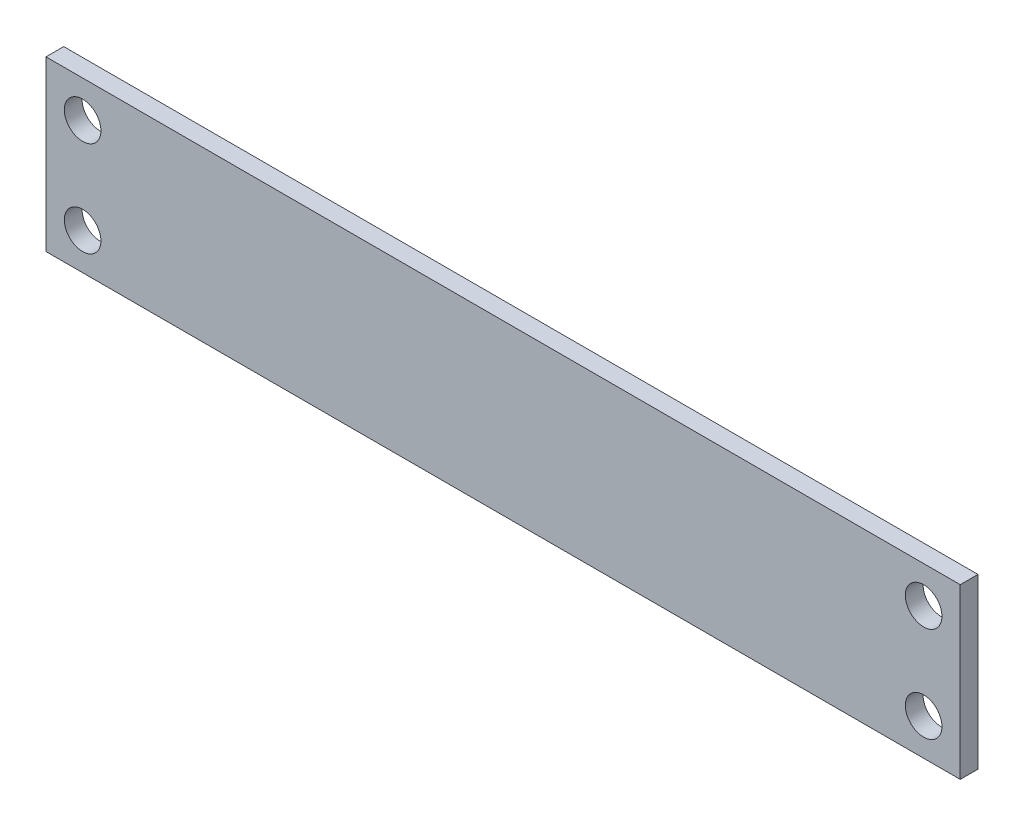
ISO-10303-21;
HEADER;
FILE_DESCRIPTION(('STEP AP214'),'2;1');
FILE_NAME('part.step','',(''),(''),'','','');
FILE_SCHEMA(('AUTOMOTIVE_DESIGN { 1 0 10303 214 1 1 1 1 }'));
ENDSEC;
DATA;
#1=APPLICATION_CONTEXT('core data for automotive mechanical design processes');
#2=APPLICATION_PROTOCOL_DEFINITION('international standard','automotive_design',2000,#1);
#3=PRODUCT_CONTEXT('',#1,'mechanical');
#4=PRODUCT('Part','Part','',(#3));
#5=PRODUCT_RELATED_PRODUCT_CATEGORY('part','',(#4));
#6=PRODUCT_DEFINITION_FORMATION('','',#4);
#7=PRODUCT_DEFINITION_CONTEXT('part definition',#1,'design');
#8=PRODUCT_DEFINITION('design','',#6,#7);
#9=PRODUCT_DEFINITION_SHAPE('','',#8);
#10=(LENGTH_UNIT() NAMED_UNIT(*) SI_UNIT(.MILLI.,.METRE.));
#11=(NAMED_UNIT(*) PLANE_ANGLE_UNIT() SI_UNIT($,.RADIAN.));
#12=(NAMED_UNIT(*) SI_UNIT($,.STERADIAN.) SOLID_ANGLE_UNIT());
#13=UNCERTAINTY_MEASURE_WITH_UNIT(LENGTH_MEASURE(1.E-05),#10,'distance_accuracy_value','');
#14=(GEOMETRIC_REPRESENTATION_CONTEXT(3) GLOBAL_UNCERTAINTY_ASSIGNED_CONTEXT((#13)) GLOBAL_UNIT_ASSIGNED_CONTEXT((#10,
#11,#12)) REPRESENTATION_CONTEXT('',''));
#15=CARTESIAN_POINT('',(0.,0.,0.));
#16=DIRECTION('',(0.,0.,1.));
#17=DIRECTION('',(1.,0.,0.));
#18=AXIS2_PLACEMENT_3D('',#15,#16,#17);
#19=CARTESIAN_POINT('',(-41.2,7.6,1.6));
#20=DIRECTION('',(1.,0.,0.));
#21=DIRECTION('',(0.,1.,0.));
#22=AXIS2_PLACEMENT_3D('',#19,#20,#21);
#23=PLANE('',#22);
#24=DIRECTION('',(0.,-1.,0.));
#25=VECTOR('',#24,1.);
#26=CARTESIAN_POINT('',(-41.2,7.6,0.));
#27=LINE('',#26,#25);
#28=CARTESIAN_POINT('',(-41.2,7.6,0.));
#29=VERTEX_POINT('',#28);
#30=CARTESIAN_POINT('',(-41.2,-7.6,0.));
#31=VERTEX_POINT('',#30);
#32=EDGE_CURVE('E102',#29,#31,#27,.T.);
#33=ORIENTED_EDGE('',*,*,#32,.T.);
#34=DIRECTION('',(0.,0.,-1.));
#35=VECTOR('',#34,1.);
#36=CARTESIAN_POINT('',(-41.2,-7.6,1.6));
#37=LINE('',#36,#35);
#38=CARTESIAN_POINT('',(-41.2,-7.6,1.6));
#39=VERTEX_POINT('',#38);
#40=EDGE_CURVE('E11',#39,#31,#37,.T.);
#41=ORIENTED_EDGE('',*,*,#40,.F.);
#42=DIRECTION('',(0.,-1.,0.));
#43=VECTOR('',#42,1.);
#44=CARTESIAN_POINT('',(-41.2,7.6,1.6));
#45=LINE('',#44,#43);
#46=CARTESIAN_POINT('',(-41.2,7.6,1.6));
#47=VERTEX_POINT('',#46);
#48=EDGE_CURVE('E90',#47,#39,#45,.T.);
#49=ORIENTED_EDGE('',*,*,#48,.F.);
#50=DIRECTION('',(0.,0.,-1.));
#51=VECTOR('',#50,1.);
#52=CARTESIAN_POINT('',(-41.2,7.6,1.6));
#53=LINE('',#52,#51);
#54=EDGE_CURVE('E98',#47,#29,#53,.T.);
#55=ORIENTED_EDGE('',*,*,#54,.T.);
#56=EDGE_LOOP('',(#33,#41,#49,#55));
#57=FACE_BOUND('',#56,.T.);
#58=ADVANCED_FACE('F39',(#57),#23,.F.);
#59=CARTESIAN_POINT('',(-41.2,-7.6,1.6));
#60=DIRECTION('',(0.,1.,0.));
#61=DIRECTION('',(0.,0.,1.));
#62=AXIS2_PLACEMENT_3D('',#59,#60,#61);
#63=PLANE('',#62);
#64=DIRECTION('',(1.,0.,0.));
#65=VECTOR('',#64,1.);
#66=CARTESIAN_POINT('',(-41.2,-7.6,0.));
#67=LINE('',#66,#65);
#68=CARTESIAN_POINT('',(41.2,-7.6,0.));
#69=VERTEX_POINT('',#68);
#70=EDGE_CURVE('E94',#31,#69,#67,.T.);
#71=ORIENTED_EDGE('',*,*,#70,.T.);
#72=DIRECTION('',(0.,0.,-1.));
#73=VECTOR('',#72,1.);
#74=CARTESIAN_POINT('',(41.2,-7.6,1.6));
#75=LINE('',#74,#73);
#76=CARTESIAN_POINT('',(41.2,-7.6,1.6));
#77=VERTEX_POINT('',#76);
#78=EDGE_CURVE('E47',#77,#69,#75,.T.);
#79=ORIENTED_EDGE('',*,*,#78,.F.);
#80=DIRECTION('',(1.,0.,0.));
#81=VECTOR('',#80,1.);
#82=CARTESIAN_POINT('',(-41.2,-7.6,1.6));
#83=LINE('',#82,#81);
#84=EDGE_CURVE('E85',#39,#77,#83,.T.);
#85=ORIENTED_EDGE('',*,*,#84,.F.);
#86=ORIENTED_EDGE('',*,*,#40,.T.);
#87=EDGE_LOOP('',(#71,#79,#85,#86));
#88=FACE_BOUND('',#87,.T.);
#89=ADVANCED_FACE('F93',(#88),#63,.F.);
#90=CARTESIAN_POINT('',(41.2,7.6,1.6));
#91=DIRECTION('',(-1.,0.,0.));
#92=DIRECTION('',(0.,-1.,0.));
#93=AXIS2_PLACEMENT_3D('',#90,#91,#92);
#94=PLANE('',#93);
#95=DIRECTION('',(0.,1.,0.));
#96=VECTOR('',#95,1.);
#97=CARTESIAN_POINT('',(41.2,7.6,0.));
#98=LINE('',#97,#96);
#99=CARTESIAN_POINT('',(41.2,7.6,0.));
#100=VERTEX_POINT('',#99);
#101=EDGE_CURVE('E72',#69,#100,#98,.T.);
#102=ORIENTED_EDGE('',*,*,#101,.T.);
#103=DIRECTION('',(0.,0.,-1.));
#104=VECTOR('',#103,1.);
#105=CARTESIAN_POINT('',(41.2,7.6,1.6));
#106=LINE('',#105,#104);
#107=CARTESIAN_POINT('',(41.2,7.6,1.6));
#108=VERTEX_POINT('',#107);
#109=EDGE_CURVE('E95',#108,#100,#106,.T.);
#110=ORIENTED_EDGE('',*,*,#109,.F.);
#111=DIRECTION('',(0.,1.,0.));
#112=VECTOR('',#111,1.);
#113=CARTESIAN_POINT('',(41.2,7.6,1.6));
#114=LINE('',#113,#112);
#115=EDGE_CURVE('E88',#77,#108,#114,.T.);
#116=ORIENTED_EDGE('',*,*,#115,.F.);
#117=ORIENTED_EDGE('',*,*,#78,.T.);
#118=EDGE_LOOP('',(#102,#110,#116,#117));
#119=FACE_BOUND('',#118,.T.);
#120=ADVANCED_FACE('F96',(#119),#94,.F.);
#121=CARTESIAN_POINT('',(-41.2,7.6,1.6));
#122=DIRECTION('',(0.,-1.,0.));
#123=DIRECTION('',(0.,0.,-1.));
#124=AXIS2_PLACEMENT_3D('',#121,#122,#123);
#125=PLANE('',#124);
#126=DIRECTION('',(-1.,0.,0.));
#127=VECTOR('',#126,1.);
#128=CARTESIAN_POINT('',(-41.2,7.6,0.));
#129=LINE('',#128,#127);
#130=EDGE_CURVE('E78',#100,#29,#129,.T.);
#131=ORIENTED_EDGE('',*,*,#130,.T.);
#132=ORIENTED_EDGE('',*,*,#54,.F.);
#133=DIRECTION('',(-1.,0.,0.));
#134=VECTOR('',#133,1.);
#135=CARTESIAN_POINT('',(-41.2,7.6,1.6));
#136=LINE('',#135,#134);
#137=EDGE_CURVE('E55',#108,#47,#136,.T.);
#138=ORIENTED_EDGE('',*,*,#137,.F.);
#139=ORIENTED_EDGE('',*,*,#109,.T.);
#140=EDGE_LOOP('',(#131,#132,#138,#139));
#141=FACE_BOUND('',#140,.T.);
#142=ADVANCED_FACE('F110',(#141),#125,.F.);
#143=CARTESIAN_POINT('',(0.,0.,1.6));
#144=DIRECTION('',(0.,0.,1.));
#145=DIRECTION('',(1.,0.,0.));
#146=AXIS2_PLACEMENT_3D('',#143,#144,#145);
#147=PLANE('',#146);
#148=CARTESIAN_POINT('',(-37.9,-4.3,1.6));
#149=DIRECTION('',(0.,0.,1.));
#150=DIRECTION('',(1.,0.,0.));
#151=AXIS2_PLACEMENT_3D('',#148,#149,#150);
#152=CIRCLE('',#151,1.65);
#153=CARTESIAN_POINT('',(-36.25,-4.3,1.6));
#154=VERTEX_POINT('',#153);
#155=EDGE_CURVE('E119',#154,#154,#152,.T.);
#156=ORIENTED_EDGE('',*,*,#155,.F.);
#157=EDGE_LOOP('',(#156));
#158=FACE_BOUND('',#157,.T.);
#159=CARTESIAN_POINT('',(37.9,4.3,1.6));
#160=DIRECTION('',(0.,0.,1.));
#161=DIRECTION('',(1.,0.,0.));
#162=AXIS2_PLACEMENT_3D('',#159,#160,#161);
#163=CIRCLE('',#162,1.65);
#164=CARTESIAN_POINT('',(39.55,4.3,1.6));
#165=VERTEX_POINT('',#164);
#166=EDGE_CURVE('E125',#165,#165,#163,.T.);
#167=ORIENTED_EDGE('',*,*,#166,.F.);
#168=EDGE_LOOP('',(#167));
#169=FACE_BOUND('',#168,.T.);
#170=CARTESIAN_POINT('',(37.9,-4.3,1.6));
#171=DIRECTION('',(0.,0.,1.));
#172=DIRECTION('',(1.,0.,0.));
#173=AXIS2_PLACEMENT_3D('',#170,#171,#172);
#174=CIRCLE('',#173,1.65);
#175=CARTESIAN_POINT('',(39.55,-4.3,1.6));
#176=VERTEX_POINT('',#175);
#177=EDGE_CURVE('E126',#176,#176,#174,.T.);
#178=ORIENTED_EDGE('',*,*,#177,.F.);
#179=EDGE_LOOP('',(#178));
#180=FACE_BOUND('',#179,.T.);
#181=CARTESIAN_POINT('',(-37.9,4.3,1.6));
#182=DIRECTION('',(0.,0.,1.));
#183=DIRECTION('',(1.,0.,0.));
#184=AXIS2_PLACEMENT_3D('',#181,#182,#183);
#185=CIRCLE('',#184,1.65);
#186=CARTESIAN_POINT('',(-36.25,4.3,1.6));
#187=VERTEX_POINT('',#186);
#188=EDGE_CURVE('E116',#187,#187,#185,.T.);
#189=ORIENTED_EDGE('',*,*,#188,.F.);
#190=EDGE_LOOP('',(#189));
#191=FACE_BOUND('',#190,.T.);
#192=ORIENTED_EDGE('',*,*,#48,.T.);
#193=ORIENTED_EDGE('',*,*,#84,.T.);
#194=ORIENTED_EDGE('',*,*,#115,.T.);
#195=ORIENTED_EDGE('',*,*,#137,.T.);
#196=EDGE_LOOP('',(#192,#193,#194,#195));
#197=FACE_BOUND('',#196,.T.);
#198=ADVANCED_FACE('F86',(#158,#169,#180,#191,#197),#147,.T.);
#199=CARTESIAN_POINT('',(0.,0.,0.));
#200=DIRECTION('',(0.,0.,1.));
#201=DIRECTION('',(1.,0.,0.));
#202=AXIS2_PLACEMENT_3D('',#199,#200,#201);
#203=PLANE('',#202);
#204=CARTESIAN_POINT('',(-37.9,-4.3,0.));
#205=DIRECTION('',(0.,0.,1.));
#206=DIRECTION('',(1.,0.,0.));
#207=AXIS2_PLACEMENT_3D('',#204,#205,#206);
#208=CIRCLE('',#207,1.65);
#209=CARTESIAN_POINT('',(-36.25,-4.3,0.));
#210=VERTEX_POINT('',#209);
#211=EDGE_CURVE('E129',#210,#210,#208,.T.);
#212=ORIENTED_EDGE('',*,*,#211,.T.);
#213=EDGE_LOOP('',(#212));
#214=FACE_BOUND('',#213,.T.);
#215=CARTESIAN_POINT('',(37.9,4.3,0.));
#216=DIRECTION('',(0.,0.,1.));
#217=DIRECTION('',(1.,0.,0.));
#218=AXIS2_PLACEMENT_3D('',#215,#216,#217);
#219=CIRCLE('',#218,1.65);
#220=CARTESIAN_POINT('',(39.55,4.3,0.));
#221=VERTEX_POINT('',#220);
#222=EDGE_CURVE('E122',#221,#221,#219,.T.);
#223=ORIENTED_EDGE('',*,*,#222,.T.);
#224=EDGE_LOOP('',(#223));
#225=FACE_BOUND('',#224,.T.);
#226=CARTESIAN_POINT('',(37.9,-4.3,0.));
#227=DIRECTION('',(0.,0.,1.));
#228=DIRECTION('',(1.,0.,0.));
#229=AXIS2_PLACEMENT_3D('',#226,#227,#228);
#230=CIRCLE('',#229,1.65);
#231=CARTESIAN_POINT('',(39.55,-4.3,0.));
#232=VERTEX_POINT('',#231);
#233=EDGE_CURVE('E134',#232,#232,#230,.T.);
#234=ORIENTED_EDGE('',*,*,#233,.T.);
#235=EDGE_LOOP('',(#234));
#236=FACE_BOUND('',#235,.T.);
#237=CARTESIAN_POINT('',(-37.9,4.3,0.));
#238=DIRECTION('',(0.,0.,1.));
#239=DIRECTION('',(1.,0.,0.));
#240=AXIS2_PLACEMENT_3D('',#237,#238,#239);
#241=CIRCLE('',#240,1.65);
#242=CARTESIAN_POINT('',(-36.25,4.3,0.));
#243=VERTEX_POINT('',#242);
#244=EDGE_CURVE('E105',#243,#243,#241,.T.);
#245=ORIENTED_EDGE('',*,*,#244,.T.);
#246=EDGE_LOOP('',(#245));
#247=FACE_BOUND('',#246,.T.);
#248=ORIENTED_EDGE('',*,*,#32,.F.);
#249=ORIENTED_EDGE('',*,*,#130,.F.);
#250=ORIENTED_EDGE('',*,*,#101,.F.);
#251=ORIENTED_EDGE('',*,*,#70,.F.);
#252=EDGE_LOOP('',(#248,#249,#250,#251));
#253=FACE_BOUND('',#252,.T.);
#254=ADVANCED_FACE('F113',(#214,#225,#236,#247,#253),#203,.F.);
#255=CARTESIAN_POINT('',(-37.9,4.3,0.));
#256=DIRECTION('',(0.,0.,1.));
#257=DIRECTION('',(1.,0.,0.));
#258=AXIS2_PLACEMENT_3D('',#255,#256,#257);
#259=CYLINDRICAL_SURFACE('',#258,1.65);
#260=ORIENTED_EDGE('',*,*,#244,.F.);
#261=EDGE_LOOP('',(#260));
#262=FACE_BOUND('',#261,.T.);
#263=ORIENTED_EDGE('',*,*,#188,.T.);
#264=EDGE_LOOP('',(#263));
#265=FACE_BOUND('',#264,.T.);
#266=ADVANCED_FACE('F148',(#262,#265),#259,.F.);
#267=CARTESIAN_POINT('',(37.9,-4.3,0.));
#268=DIRECTION('',(0.,0.,1.));
#269=DIRECTION('',(1.,0.,0.));
#270=AXIS2_PLACEMENT_3D('',#267,#268,#269);
#271=CYLINDRICAL_SURFACE('',#270,1.65);
#272=ORIENTED_EDGE('',*,*,#233,.F.);
#273=EDGE_LOOP('',(#272));
#274=FACE_BOUND('',#273,.T.);
#275=ORIENTED_EDGE('',*,*,#177,.T.);
#276=EDGE_LOOP('',(#275));
#277=FACE_BOUND('',#276,.T.);
#278=ADVANCED_FACE('F140',(#274,#277),#271,.F.);
#279=CARTESIAN_POINT('',(37.9,4.3,0.));
#280=DIRECTION('',(0.,0.,1.));
#281=DIRECTION('',(1.,0.,0.));
#282=AXIS2_PLACEMENT_3D('',#279,#280,#281);
#283=CYLINDRICAL_SURFACE('',#282,1.65);
#284=ORIENTED_EDGE('',*,*,#222,.F.);
#285=EDGE_LOOP('',(#284));
#286=FACE_BOUND('',#285,.T.);
#287=ORIENTED_EDGE('',*,*,#166,.T.);
#288=EDGE_LOOP('',(#287));
#289=FACE_BOUND('',#288,.T.);
#290=ADVANCED_FACE('F156',(#286,#289),#283,.F.);
#291=CARTESIAN_POINT('',(-37.9,-4.3,0.));
#292=DIRECTION('',(0.,0.,1.));
#293=DIRECTION('',(1.,0.,0.));
#294=AXIS2_PLACEMENT_3D('',#291,#292,#293);
#295=CYLINDRICAL_SURFACE('',#294,1.65);
#296=ORIENTED_EDGE('',*,*,#211,.F.);
#297=EDGE_LOOP('',(#296));
#298=FACE_BOUND('',#297,.T.);
#299=ORIENTED_EDGE('',*,*,#155,.T.);
#300=EDGE_LOOP('',(#299));
#301=FACE_BOUND('',#300,.T.);
#302=ADVANCED_FACE('F207',(#298,#301),#295,.F.);
#303=CLOSED_SHELL('',(#58,#89,#120,#142,#198,#254,#266,#278,#290,#302));
#304=MANIFOLD_SOLID_BREP('B2',#303);
#305=ADVANCED_BREP_SHAPE_REPRESENTATION('',(#18,#304),#14);
#306=SHAPE_DEFINITION_REPRESENTATION(#9,#305);
ENDSEC;
END-ISO-10303-21;
